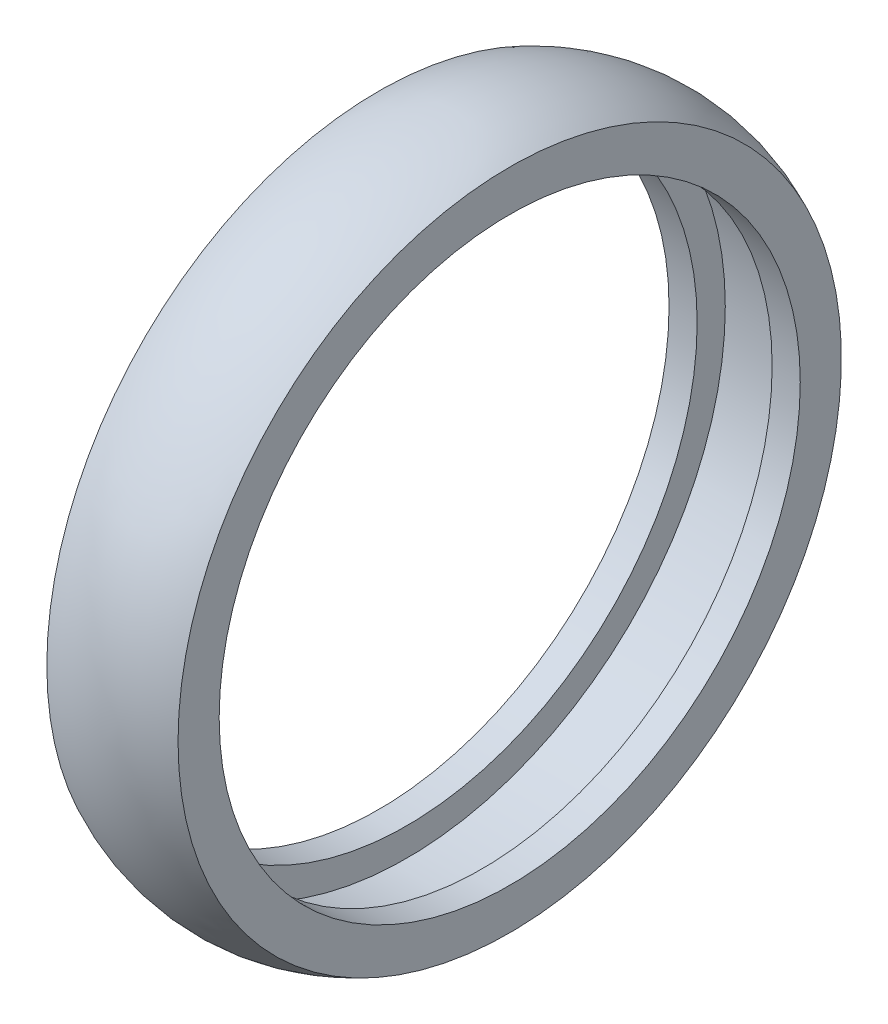
ISO-10303-21;
HEADER;
FILE_DESCRIPTION(('STEP AP214'),'2;1');
FILE_NAME('part.step','',(''),(''),'','','');
FILE_SCHEMA(('AUTOMOTIVE_DESIGN { 1 0 10303 214 1 1 1 1 }'));
ENDSEC;
DATA;
#1=APPLICATION_CONTEXT('core data for automotive mechanical design processes');
#2=APPLICATION_PROTOCOL_DEFINITION('international standard','automotive_design',2000,#1);
#3=PRODUCT_CONTEXT('',#1,'mechanical');
#4=PRODUCT('Part','Part','',(#3));
#5=PRODUCT_RELATED_PRODUCT_CATEGORY('part','',(#4));
#6=PRODUCT_DEFINITION_FORMATION('','',#4);
#7=PRODUCT_DEFINITION_CONTEXT('part definition',#1,'design');
#8=PRODUCT_DEFINITION('design','',#6,#7);
#9=PRODUCT_DEFINITION_SHAPE('','',#8);
#10=(LENGTH_UNIT() NAMED_UNIT(*) SI_UNIT(.MILLI.,.METRE.));
#11=(NAMED_UNIT(*) PLANE_ANGLE_UNIT() SI_UNIT($,.RADIAN.));
#12=(NAMED_UNIT(*) SI_UNIT($,.STERADIAN.) SOLID_ANGLE_UNIT());
#13=UNCERTAINTY_MEASURE_WITH_UNIT(LENGTH_MEASURE(1.E-05),#10,'distance_accuracy_value','');
#14=(GEOMETRIC_REPRESENTATION_CONTEXT(3) GLOBAL_UNCERTAINTY_ASSIGNED_CONTEXT((#13)) GLOBAL_UNIT_ASSIGNED_CONTEXT((#10,
#11,#12)) REPRESENTATION_CONTEXT('',''));
#15=CARTESIAN_POINT('',(0.,0.,0.));
#16=DIRECTION('',(0.,0.,1.));
#17=DIRECTION('',(1.,0.,0.));
#18=AXIS2_PLACEMENT_3D('',#15,#16,#17);
#19=CARTESIAN_POINT('',(-4.,34.,0.));
#20=DIRECTION('',(-1.,0.,0.));
#21=DIRECTION('',(0.,0.,1.));
#22=AXIS2_PLACEMENT_3D('',#19,#20,#21);
#23=PLANE('',#22);
#24=CARTESIAN_POINT('',(-4.,0.,0.));
#25=DIRECTION('',(-1.,0.,0.));
#26=DIRECTION('',(0.,0.,1.));
#27=AXIS2_PLACEMENT_3D('',#24,#25,#26);
#28=CIRCLE('',#27,34.);
#29=CARTESIAN_POINT('',(-4.,0.,34.));
#30=VERTEX_POINT('',#29);
#31=EDGE_CURVE('E61',#30,#30,#28,.T.);
#32=ORIENTED_EDGE('',*,*,#31,.F.);
#33=EDGE_LOOP('',(#32));
#34=FACE_BOUND('',#33,.T.);
#35=CARTESIAN_POINT('',(-4.,0.,0.));
#36=DIRECTION('',(-1.,0.,0.));
#37=DIRECTION('',(0.,0.,1.));
#38=AXIS2_PLACEMENT_3D('',#35,#36,#37);
#39=CIRCLE('',#38,31.);
#40=CARTESIAN_POINT('',(-4.,0.,31.));
#41=VERTEX_POINT('',#40);
#42=EDGE_CURVE('E10',#41,#41,#39,.T.);
#43=ORIENTED_EDGE('',*,*,#42,.T.);
#44=EDGE_LOOP('',(#43));
#45=FACE_BOUND('',#44,.T.);
#46=ADVANCED_FACE('F33',(#34,#45),#23,.F.);
#47=CARTESIAN_POINT('',(-690.466838323814,0.,0.));
#48=DIRECTION('',(-1.,0.,0.));
#49=DIRECTION('',(0.,0.,1.));
#50=AXIS2_PLACEMENT_3D('',#47,#48,#49);
#51=CYLINDRICAL_SURFACE('',#50,31.);
#52=ORIENTED_EDGE('',*,*,#42,.F.);
#53=EDGE_LOOP('',(#52));
#54=FACE_BOUND('',#53,.T.);
#55=CARTESIAN_POINT('',(-7.00000000000001,0.,0.));
#56=DIRECTION('',(-1.,0.,0.));
#57=DIRECTION('',(0.,0.,1.));
#58=AXIS2_PLACEMENT_3D('',#55,#56,#57);
#59=CIRCLE('',#58,31.);
#60=CARTESIAN_POINT('',(-7.00000000000001,0.,31.));
#61=VERTEX_POINT('',#60);
#62=EDGE_CURVE('E39',#61,#61,#59,.T.);
#63=ORIENTED_EDGE('',*,*,#62,.T.);
#64=EDGE_LOOP('',(#63));
#65=FACE_BOUND('',#64,.T.);
#66=ADVANCED_FACE('F68',(#54,#65),#51,.F.);
#67=CARTESIAN_POINT('',(-7.,31.,0.));
#68=DIRECTION('',(1.,0.,0.));
#69=DIRECTION('',(0.,0.,-1.));
#70=AXIS2_PLACEMENT_3D('',#67,#68,#69);
#71=PLANE('',#70);
#72=ORIENTED_EDGE('',*,*,#62,.F.);
#73=EDGE_LOOP('',(#72));
#74=FACE_BOUND('',#73,.T.);
#75=CARTESIAN_POINT('',(-7.00000000000001,0.,0.));
#76=DIRECTION('',(-1.,0.,0.));
#77=DIRECTION('',(0.,0.,1.));
#78=AXIS2_PLACEMENT_3D('',#75,#76,#77);
#79=CIRCLE('',#78,35.3874945699382);
#80=CARTESIAN_POINT('',(-7.00000000000001,0.,35.3874945699382));
#81=VERTEX_POINT('',#80);
#82=EDGE_CURVE('E43',#81,#81,#79,.T.);
#83=ORIENTED_EDGE('',*,*,#82,.T.);
#84=EDGE_LOOP('',(#83));
#85=FACE_BOUND('',#84,.T.);
#86=ADVANCED_FACE('F72',(#74,#85),#71,.F.);
#87=CARTESIAN_POINT('',(0.,0.,0.));
#88=DIRECTION('',(-1.,0.,0.));
#89=DIRECTION('',(0.,0.,1.));
#90=AXIS2_PLACEMENT_3D('',#87,#88,#89);
#91=TOROIDAL_SURFACE('',#90,21.,16.);
#92=ORIENTED_EDGE('',*,*,#82,.F.);
#93=EDGE_LOOP('',(#92));
#94=FACE_BOUND('',#93,.T.);
#95=CARTESIAN_POINT('',(7.00000000000001,0.,0.));
#96=DIRECTION('',(-1.,0.,0.));
#97=DIRECTION('',(0.,0.,1.));
#98=AXIS2_PLACEMENT_3D('',#95,#96,#97);
#99=CIRCLE('',#98,35.3874945699382);
#100=CARTESIAN_POINT('',(7.00000000000001,0.,35.3874945699382));
#101=VERTEX_POINT('',#100);
#102=EDGE_CURVE('E47',#101,#101,#99,.T.);
#103=ORIENTED_EDGE('',*,*,#102,.T.);
#104=EDGE_LOOP('',(#103));
#105=FACE_BOUND('',#104,.T.);
#106=ADVANCED_FACE('F77',(#94,#105),#91,.T.);
#107=CARTESIAN_POINT('',(7.,31.,0.));
#108=DIRECTION('',(-1.,0.,0.));
#109=DIRECTION('',(0.,0.,1.));
#110=AXIS2_PLACEMENT_3D('',#107,#108,#109);
#111=PLANE('',#110);
#112=ORIENTED_EDGE('',*,*,#102,.F.);
#113=EDGE_LOOP('',(#112));
#114=FACE_BOUND('',#113,.T.);
#115=CARTESIAN_POINT('',(7.00000000000001,0.,0.));
#116=DIRECTION('',(-1.,0.,0.));
#117=DIRECTION('',(0.,0.,1.));
#118=AXIS2_PLACEMENT_3D('',#115,#116,#117);
#119=CIRCLE('',#118,31.);
#120=CARTESIAN_POINT('',(7.00000000000001,0.,31.));
#121=VERTEX_POINT('',#120);
#122=EDGE_CURVE('E52',#121,#121,#119,.T.);
#123=ORIENTED_EDGE('',*,*,#122,.T.);
#124=EDGE_LOOP('',(#123));
#125=FACE_BOUND('',#124,.T.);
#126=ADVANCED_FACE('F83',(#114,#125),#111,.F.);
#127=CARTESIAN_POINT('',(-690.466838323814,0.,0.));
#128=DIRECTION('',(-1.,0.,0.));
#129=DIRECTION('',(0.,0.,1.));
#130=AXIS2_PLACEMENT_3D('',#127,#128,#129);
#131=CYLINDRICAL_SURFACE('',#130,31.);
#132=ORIENTED_EDGE('',*,*,#122,.F.);
#133=EDGE_LOOP('',(#132));
#134=FACE_BOUND('',#133,.T.);
#135=CARTESIAN_POINT('',(4.,0.,0.));
#136=DIRECTION('',(-1.,0.,0.));
#137=DIRECTION('',(0.,0.,1.));
#138=AXIS2_PLACEMENT_3D('',#135,#136,#137);
#139=CIRCLE('',#138,31.);
#140=CARTESIAN_POINT('',(4.,0.,31.));
#141=VERTEX_POINT('',#140);
#142=EDGE_CURVE('E55',#141,#141,#139,.T.);
#143=ORIENTED_EDGE('',*,*,#142,.T.);
#144=EDGE_LOOP('',(#143));
#145=FACE_BOUND('',#144,.T.);
#146=ADVANCED_FACE('F87',(#134,#145),#131,.F.);
#147=CARTESIAN_POINT('',(4.,34.,0.));
#148=DIRECTION('',(1.,0.,0.));
#149=DIRECTION('',(0.,0.,-1.));
#150=AXIS2_PLACEMENT_3D('',#147,#148,#149);
#151=PLANE('',#150);
#152=ORIENTED_EDGE('',*,*,#142,.F.);
#153=EDGE_LOOP('',(#152));
#154=FACE_BOUND('',#153,.T.);
#155=CARTESIAN_POINT('',(4.,0.,0.));
#156=DIRECTION('',(-1.,0.,0.));
#157=DIRECTION('',(0.,0.,1.));
#158=AXIS2_PLACEMENT_3D('',#155,#156,#157);
#159=CIRCLE('',#158,34.);
#160=CARTESIAN_POINT('',(4.,0.,34.));
#161=VERTEX_POINT('',#160);
#162=EDGE_CURVE('E58',#161,#161,#159,.T.);
#163=ORIENTED_EDGE('',*,*,#162,.T.);
#164=EDGE_LOOP('',(#163));
#165=FACE_BOUND('',#164,.T.);
#166=ADVANCED_FACE('F91',(#154,#165),#151,.F.);
#167=CARTESIAN_POINT('',(-690.466838323814,0.,0.));
#168=DIRECTION('',(-1.,0.,0.));
#169=DIRECTION('',(0.,0.,1.));
#170=AXIS2_PLACEMENT_3D('',#167,#168,#169);
#171=CYLINDRICAL_SURFACE('',#170,34.);
#172=ORIENTED_EDGE('',*,*,#162,.F.);
#173=EDGE_LOOP('',(#172));
#174=FACE_BOUND('',#173,.T.);
#175=ORIENTED_EDGE('',*,*,#31,.T.);
#176=EDGE_LOOP('',(#175));
#177=FACE_BOUND('',#176,.T.);
#178=ADVANCED_FACE('F65',(#174,#177),#171,.F.);
#179=CLOSED_SHELL('',(#46,#66,#86,#106,#126,#146,#166,#178));
#180=MANIFOLD_SOLID_BREP('B2',#179);
#181=ADVANCED_BREP_SHAPE_REPRESENTATION('',(#18,#180),#14);
#182=SHAPE_DEFINITION_REPRESENTATION(#9,#181);
ENDSEC;
END-ISO-10303-21;
